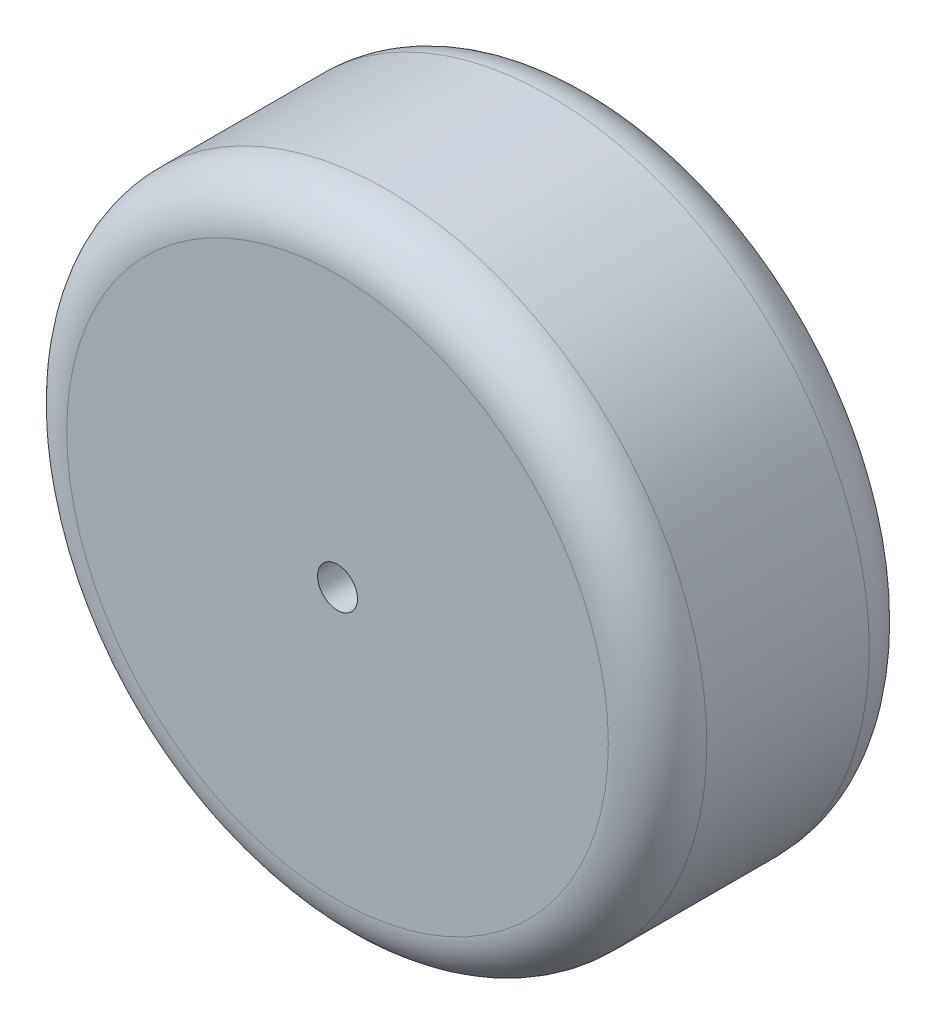
ISO-10303-21;
HEADER;
FILE_DESCRIPTION(('STEP AP214'),'2;1');
FILE_NAME('part.step','',(''),(''),'','','');
FILE_SCHEMA(('AUTOMOTIVE_DESIGN { 1 0 10303 214 1 1 1 1 }'));
ENDSEC;
DATA;
#1=APPLICATION_CONTEXT('core data for automotive mechanical design processes');
#2=APPLICATION_PROTOCOL_DEFINITION('international standard','automotive_design',2000,#1);
#3=PRODUCT_CONTEXT('',#1,'mechanical');
#4=PRODUCT('Part','Part','',(#3));
#5=PRODUCT_RELATED_PRODUCT_CATEGORY('part','',(#4));
#6=PRODUCT_DEFINITION_FORMATION('','',#4);
#7=PRODUCT_DEFINITION_CONTEXT('part definition',#1,'design');
#8=PRODUCT_DEFINITION('design','',#6,#7);
#9=PRODUCT_DEFINITION_SHAPE('','',#8);
#10=(LENGTH_UNIT() NAMED_UNIT(*) SI_UNIT(.MILLI.,.METRE.));
#11=(NAMED_UNIT(*) PLANE_ANGLE_UNIT() SI_UNIT($,.RADIAN.));
#12=(NAMED_UNIT(*) SI_UNIT($,.STERADIAN.) SOLID_ANGLE_UNIT());
#13=UNCERTAINTY_MEASURE_WITH_UNIT(LENGTH_MEASURE(1.E-05),#10,'distance_accuracy_value','');
#14=(GEOMETRIC_REPRESENTATION_CONTEXT(3) GLOBAL_UNCERTAINTY_ASSIGNED_CONTEXT((#13)) GLOBAL_UNIT_ASSIGNED_CONTEXT((#10,
#11,#12)) REPRESENTATION_CONTEXT('',''));
#15=CARTESIAN_POINT('',(0.,0.,0.));
#16=DIRECTION('',(0.,0.,1.));
#17=DIRECTION('',(1.,0.,0.));
#18=AXIS2_PLACEMENT_3D('',#15,#16,#17);
#19=CARTESIAN_POINT('',(0.,0.,23.5));
#20=DIRECTION('',(0.,0.,1.));
#21=DIRECTION('',(1.,0.,0.));
#22=AXIS2_PLACEMENT_3D('',#19,#20,#21);
#23=PLANE('',#22);
#24=CARTESIAN_POINT('',(0.,0.,23.5));
#25=DIRECTION('',(0.,0.,1.));
#26=DIRECTION('',(1.,0.,0.));
#27=AXIS2_PLACEMENT_3D('',#24,#25,#26);
#28=CIRCLE('',#27,13.);
#29=CARTESIAN_POINT('',(13.,0.,23.5));
#30=VERTEX_POINT('',#29);
#31=EDGE_CURVE('E190',#30,#30,#28,.T.);
#32=ORIENTED_EDGE('',*,*,#31,.T.);
#33=EDGE_LOOP('',(#32));
#34=FACE_BOUND('',#33,.T.);
#35=CARTESIAN_POINT('',(0.,0.,23.5));
#36=DIRECTION('',(0.,0.,1.));
#37=DIRECTION('',(1.,0.,0.));
#38=AXIS2_PLACEMENT_3D('',#35,#36,#37);
#39=CIRCLE('',#38,22.5);
#40=CARTESIAN_POINT('',(22.5,0.,23.5));
#41=VERTEX_POINT('',#40);
#42=EDGE_CURVE('E182',#41,#41,#39,.F.);
#43=ORIENTED_EDGE('',*,*,#42,.T.);
#44=EDGE_LOOP('',(#43));
#45=FACE_BOUND('',#44,.T.);
#46=ADVANCED_FACE('F49',(#34,#45),#23,.F.);
#47=CARTESIAN_POINT('',(0.,0.,26.5));
#48=DIRECTION('',(0.,0.,-1.));
#49=DIRECTION('',(-1.,0.,0.));
#50=AXIS2_PLACEMENT_3D('',#47,#48,#49);
#51=CYLINDRICAL_SURFACE('',#50,32.5);
#52=CARTESIAN_POINT('',(0.,0.,21.5));
#53=DIRECTION('',(0.,0.,1.));
#54=DIRECTION('',(1.,0.,0.));
#55=AXIS2_PLACEMENT_3D('',#52,#53,#54);
#56=CIRCLE('',#55,32.5);
#57=CARTESIAN_POINT('',(32.5,0.,21.5));
#58=VERTEX_POINT('',#57);
#59=EDGE_CURVE('E58',#58,#58,#56,.F.);
#60=ORIENTED_EDGE('',*,*,#59,.T.);
#61=EDGE_LOOP('',(#60));
#62=FACE_BOUND('',#61,.T.);
#63=CARTESIAN_POINT('',(0.,0.,5.));
#64=DIRECTION('',(0.,0.,1.));
#65=DIRECTION('',(1.,0.,0.));
#66=AXIS2_PLACEMENT_3D('',#63,#64,#65);
#67=CIRCLE('',#66,32.5);
#68=CARTESIAN_POINT('',(32.5,0.,5.));
#69=VERTEX_POINT('',#68);
#70=EDGE_CURVE('E202',#69,#69,#67,.T.);
#71=ORIENTED_EDGE('',*,*,#70,.T.);
#72=EDGE_LOOP('',(#71));
#73=FACE_BOUND('',#72,.T.);
#74=ADVANCED_FACE('F209',(#62,#73),#51,.T.);
#75=CARTESIAN_POINT('',(0.,0.,26.5));
#76=DIRECTION('',(0.,0.,1.));
#77=DIRECTION('',(1.,0.,0.));
#78=AXIS2_PLACEMENT_3D('',#75,#76,#77);
#79=PLANE('',#78);
#80=CARTESIAN_POINT('',(0.,0.,26.5));
#81=DIRECTION('',(0.,0.,1.));
#82=DIRECTION('',(1.,0.,0.));
#83=AXIS2_PLACEMENT_3D('',#80,#81,#82);
#84=CIRCLE('',#83,27.5);
#85=CARTESIAN_POINT('',(27.5,0.,26.5));
#86=VERTEX_POINT('',#85);
#87=EDGE_CURVE('E194',#86,#86,#84,.T.);
#88=ORIENTED_EDGE('',*,*,#87,.T.);
#89=EDGE_LOOP('',(#88));
#90=FACE_BOUND('',#89,.T.);
#91=CARTESIAN_POINT('',(0.,0.,26.5));
#92=DIRECTION('',(0.,0.,1.));
#93=DIRECTION('',(1.,0.,0.));
#94=AXIS2_PLACEMENT_3D('',#91,#92,#93);
#95=CIRCLE('',#94,2.025);
#96=CARTESIAN_POINT('',(2.025,0.,26.5));
#97=VERTEX_POINT('',#96);
#98=EDGE_CURVE('E198',#97,#97,#95,.T.);
#99=ORIENTED_EDGE('',*,*,#98,.F.);
#100=EDGE_LOOP('',(#99));
#101=FACE_BOUND('',#100,.T.);
#102=ADVANCED_FACE('F218',(#90,#101),#79,.T.);
#103=CARTESIAN_POINT('',(0.,0.,0.));
#104=DIRECTION('',(0.,0.,1.));
#105=DIRECTION('',(1.,0.,0.));
#106=AXIS2_PLACEMENT_3D('',#103,#104,#105);
#107=PLANE('',#106);
#108=CARTESIAN_POINT('',(0.,0.,0.));
#109=DIRECTION('',(0.,0.,1.));
#110=DIRECTION('',(1.,0.,0.));
#111=AXIS2_PLACEMENT_3D('',#108,#109,#110);
#112=CIRCLE('',#111,27.5);
#113=CARTESIAN_POINT('',(27.5,0.,0.));
#114=VERTEX_POINT('',#113);
#115=EDGE_CURVE('E12',#114,#114,#112,.F.);
#116=ORIENTED_EDGE('',*,*,#115,.T.);
#117=EDGE_LOOP('',(#116));
#118=FACE_BOUND('',#117,.T.);
#119=CARTESIAN_POINT('',(0.,0.,0.));
#120=DIRECTION('',(0.,0.,-1.));
#121=DIRECTION('',(-1.,0.,0.));
#122=AXIS2_PLACEMENT_3D('',#119,#120,#121);
#123=CIRCLE('',#122,22.5);
#124=CARTESIAN_POINT('',(-22.5,0.,0.));
#125=VERTEX_POINT('',#124);
#126=EDGE_CURVE('E178',#125,#125,#123,.T.);
#127=ORIENTED_EDGE('',*,*,#126,.F.);
#128=EDGE_LOOP('',(#127));
#129=FACE_BOUND('',#128,.T.);
#130=ADVANCED_FACE('F221',(#118,#129),#107,.F.);
#131=CARTESIAN_POINT('',(0.,0.,90.1396103067893));
#132=DIRECTION('',(0.,0.,-1.));
#133=DIRECTION('',(-1.,0.,0.));
#134=AXIS2_PLACEMENT_3D('',#131,#132,#133);
#135=CYLINDRICAL_SURFACE('',#134,22.5);
#136=ORIENTED_EDGE('',*,*,#126,.T.);
#137=EDGE_LOOP('',(#136));
#138=FACE_BOUND('',#137,.T.);
#139=ORIENTED_EDGE('',*,*,#42,.F.);
#140=EDGE_LOOP('',(#139));
#141=FACE_BOUND('',#140,.T.);
#142=ADVANCED_FACE('F258',(#138,#141),#135,.F.);
#143=CARTESIAN_POINT('',(0.,0.,8.5));
#144=DIRECTION('',(0.,0.,-1.));
#145=DIRECTION('',(-1.,0.,0.));
#146=AXIS2_PLACEMENT_3D('',#143,#144,#145);
#147=PLANE('',#146);
#148=CARTESIAN_POINT('',(0.,0.,8.5));
#149=DIRECTION('',(0.,0.,-1.));
#150=DIRECTION('',(-1.,0.,0.));
#151=AXIS2_PLACEMENT_3D('',#148,#149,#150);
#152=CIRCLE('',#151,9.);
#153=CARTESIAN_POINT('',(-9.,0.,8.5));
#154=VERTEX_POINT('',#153);
#155=EDGE_CURVE('E120',#154,#154,#152,.T.);
#156=ORIENTED_EDGE('',*,*,#155,.T.);
#157=EDGE_LOOP('',(#156));
#158=FACE_BOUND('',#157,.T.);
#159=DIRECTION('',(0.,1.,0.));
#160=VECTOR('',#159,1.);
#161=CARTESIAN_POINT('',(-6.,-3.46410161513776,8.5));
#162=LINE('',#161,#160);
#163=CARTESIAN_POINT('',(-6.,-3.46410161513776,8.5));
#164=VERTEX_POINT('',#163);
#165=CARTESIAN_POINT('',(-6.,3.46410161513776,8.5));
#166=VERTEX_POINT('',#165);
#167=EDGE_CURVE('E111',#164,#166,#162,.T.);
#168=ORIENTED_EDGE('',*,*,#167,.F.);
#169=DIRECTION('',(-0.866025403784439,0.5,0.));
#170=VECTOR('',#169,1.);
#171=CARTESIAN_POINT('',(0.,-6.92820323027551,8.5));
#172=LINE('',#171,#170);
#173=CARTESIAN_POINT('',(0.,-6.92820323027551,8.5));
#174=VERTEX_POINT('',#173);
#175=EDGE_CURVE('E102',#174,#164,#172,.T.);
#176=ORIENTED_EDGE('',*,*,#175,.F.);
#177=DIRECTION('',(-0.866025403784438,-0.5,0.));
#178=VECTOR('',#177,1.);
#179=CARTESIAN_POINT('',(6.,-3.46410161513775,8.5));
#180=LINE('',#179,#178);
#181=CARTESIAN_POINT('',(6.,-3.46410161513775,8.5));
#182=VERTEX_POINT('',#181);
#183=EDGE_CURVE('E139',#182,#174,#180,.T.);
#184=ORIENTED_EDGE('',*,*,#183,.F.);
#185=DIRECTION('',(0.,-1.,0.));
#186=VECTOR('',#185,1.);
#187=CARTESIAN_POINT('',(6.,3.46410161513776,8.5));
#188=LINE('',#187,#186);
#189=CARTESIAN_POINT('',(6.,3.46410161513776,8.5));
#190=VERTEX_POINT('',#189);
#191=EDGE_CURVE('E136',#190,#182,#188,.T.);
#192=ORIENTED_EDGE('',*,*,#191,.F.);
#193=DIRECTION('',(0.866025403784439,-0.5,0.));
#194=VECTOR('',#193,1.);
#195=CARTESIAN_POINT('',(0.,6.92820323027551,8.5));
#196=LINE('',#195,#194);
#197=CARTESIAN_POINT('',(0.,6.92820323027551,8.5));
#198=VERTEX_POINT('',#197);
#199=EDGE_CURVE('E130',#198,#190,#196,.T.);
#200=ORIENTED_EDGE('',*,*,#199,.F.);
#201=DIRECTION('',(0.866025403784439,0.5,0.));
#202=VECTOR('',#201,1.);
#203=CARTESIAN_POINT('',(-6.,3.46410161513776,8.5));
#204=LINE('',#203,#202);
#205=EDGE_CURVE('E126',#166,#198,#204,.T.);
#206=ORIENTED_EDGE('',*,*,#205,.F.);
#207=EDGE_LOOP('',(#168,#176,#184,#192,#200,#206));
#208=FACE_BOUND('',#207,.T.);
#209=ADVANCED_FACE('F124',(#158,#208),#147,.T.);
#210=CARTESIAN_POINT('',(0.,0.,8.5));
#211=DIRECTION('',(0.,0.,1.));
#212=DIRECTION('',(1.,0.,0.));
#213=AXIS2_PLACEMENT_3D('',#210,#211,#212);
#214=CYLINDRICAL_SURFACE('',#213,9.);
#215=CARTESIAN_POINT('',(0.,0.,19.5));
#216=DIRECTION('',(0.,0.,1.));
#217=DIRECTION('',(1.,0.,0.));
#218=AXIS2_PLACEMENT_3D('',#215,#216,#217);
#219=CIRCLE('',#218,9.);
#220=CARTESIAN_POINT('',(9.,0.,19.5));
#221=VERTEX_POINT('',#220);
#222=EDGE_CURVE('E186',#221,#221,#219,.F.);
#223=ORIENTED_EDGE('',*,*,#222,.T.);
#224=EDGE_LOOP('',(#223));
#225=FACE_BOUND('',#224,.T.);
#226=ORIENTED_EDGE('',*,*,#155,.F.);
#227=EDGE_LOOP('',(#226));
#228=FACE_BOUND('',#227,.T.);
#229=ADVANCED_FACE('F272',(#225,#228),#214,.T.);
#230=CARTESIAN_POINT('',(0.,-6.92820323027551,8.5));
#231=DIRECTION('',(0.5,0.866025403784439,0.));
#232=DIRECTION('',(-0.866025403784439,0.5,0.));
#233=AXIS2_PLACEMENT_3D('',#230,#231,#232);
#234=PLANE('',#233);
#235=DIRECTION('',(-0.866025403784439,0.5,0.));
#236=VECTOR('',#235,1.);
#237=CARTESIAN_POINT('',(0.,-6.92820323027551,23.5));
#238=LINE('',#237,#236);
#239=CARTESIAN_POINT('',(0.,-6.92820323027551,23.5));
#240=VERTEX_POINT('',#239);
#241=CARTESIAN_POINT('',(-6.,-3.46410161513776,23.5));
#242=VERTEX_POINT('',#241);
#243=EDGE_CURVE('E142',#240,#242,#238,.T.);
#244=ORIENTED_EDGE('',*,*,#243,.F.);
#245=DIRECTION('',(0.,0.,1.));
#246=VECTOR('',#245,1.);
#247=CARTESIAN_POINT('',(0.,-6.92820323027551,8.5));
#248=LINE('',#247,#246);
#249=EDGE_CURVE('E65',#174,#240,#248,.T.);
#250=ORIENTED_EDGE('',*,*,#249,.F.);
#251=ORIENTED_EDGE('',*,*,#175,.T.);
#252=DIRECTION('',(0.,0.,1.));
#253=VECTOR('',#252,1.);
#254=CARTESIAN_POINT('',(-6.,-3.46410161513776,8.5));
#255=LINE('',#254,#253);
#256=EDGE_CURVE('E105',#164,#242,#255,.T.);
#257=ORIENTED_EDGE('',*,*,#256,.T.);
#258=EDGE_LOOP('',(#244,#250,#251,#257));
#259=FACE_BOUND('',#258,.T.);
#260=ADVANCED_FACE('F104',(#259),#234,.T.);
#261=CARTESIAN_POINT('',(-6.,-3.46410161513776,8.5));
#262=DIRECTION('',(1.,0.,0.));
#263=DIRECTION('',(0.,0.,-1.));
#264=AXIS2_PLACEMENT_3D('',#261,#262,#263);
#265=PLANE('',#264);
#266=DIRECTION('',(0.,1.,0.));
#267=VECTOR('',#266,1.);
#268=CARTESIAN_POINT('',(-6.,-3.46410161513776,23.5));
#269=LINE('',#268,#267);
#270=CARTESIAN_POINT('',(-6.,3.46410161513776,23.5));
#271=VERTEX_POINT('',#270);
#272=EDGE_CURVE('E118',#242,#271,#269,.T.);
#273=ORIENTED_EDGE('',*,*,#272,.F.);
#274=ORIENTED_EDGE('',*,*,#256,.F.);
#275=ORIENTED_EDGE('',*,*,#167,.T.);
#276=DIRECTION('',(0.,0.,1.));
#277=VECTOR('',#276,1.);
#278=CARTESIAN_POINT('',(-6.,3.46410161513776,8.5));
#279=LINE('',#278,#277);
#280=EDGE_CURVE('E121',#166,#271,#279,.T.);
#281=ORIENTED_EDGE('',*,*,#280,.T.);
#282=EDGE_LOOP('',(#273,#274,#275,#281));
#283=FACE_BOUND('',#282,.T.);
#284=ADVANCED_FACE('F115',(#283),#265,.T.);
#285=CARTESIAN_POINT('',(-6.,3.46410161513776,8.5));
#286=DIRECTION('',(0.5,-0.866025403784439,0.));
#287=DIRECTION('',(0.866025403784439,0.5,0.));
#288=AXIS2_PLACEMENT_3D('',#285,#286,#287);
#289=PLANE('',#288);
#290=DIRECTION('',(0.866025403784439,0.5,0.));
#291=VECTOR('',#290,1.);
#292=CARTESIAN_POINT('',(-6.,3.46410161513776,23.5));
#293=LINE('',#292,#291);
#294=CARTESIAN_POINT('',(0.,6.92820323027551,23.5));
#295=VERTEX_POINT('',#294);
#296=EDGE_CURVE('E148',#271,#295,#293,.T.);
#297=ORIENTED_EDGE('',*,*,#296,.F.);
#298=ORIENTED_EDGE('',*,*,#280,.F.);
#299=ORIENTED_EDGE('',*,*,#205,.T.);
#300=DIRECTION('',(0.,0.,1.));
#301=VECTOR('',#300,1.);
#302=CARTESIAN_POINT('',(0.,6.92820323027551,8.5));
#303=LINE('',#302,#301);
#304=EDGE_CURVE('E170',#198,#295,#303,.T.);
#305=ORIENTED_EDGE('',*,*,#304,.T.);
#306=EDGE_LOOP('',(#297,#298,#299,#305));
#307=FACE_BOUND('',#306,.T.);
#308=ADVANCED_FACE('F288',(#307),#289,.T.);
#309=CARTESIAN_POINT('',(0.,6.92820323027551,8.5));
#310=DIRECTION('',(-0.5,-0.866025403784439,0.));
#311=DIRECTION('',(0.866025403784439,-0.5,0.));
#312=AXIS2_PLACEMENT_3D('',#309,#310,#311);
#313=PLANE('',#312);
#314=DIRECTION('',(0.866025403784439,-0.5,0.));
#315=VECTOR('',#314,1.);
#316=CARTESIAN_POINT('',(0.,6.92820323027551,23.5));
#317=LINE('',#316,#315);
#318=CARTESIAN_POINT('',(6.,3.46410161513776,23.5));
#319=VERTEX_POINT('',#318);
#320=EDGE_CURVE('E152',#295,#319,#317,.T.);
#321=ORIENTED_EDGE('',*,*,#320,.F.);
#322=ORIENTED_EDGE('',*,*,#304,.F.);
#323=ORIENTED_EDGE('',*,*,#199,.T.);
#324=DIRECTION('',(0.,0.,1.));
#325=VECTOR('',#324,1.);
#326=CARTESIAN_POINT('',(6.,3.46410161513776,8.5));
#327=LINE('',#326,#325);
#328=EDGE_CURVE('E167',#190,#319,#327,.T.);
#329=ORIENTED_EDGE('',*,*,#328,.T.);
#330=EDGE_LOOP('',(#321,#322,#323,#329));
#331=FACE_BOUND('',#330,.T.);
#332=ADVANCED_FACE('F246',(#331),#313,.T.);
#333=CARTESIAN_POINT('',(6.,3.46410161513776,8.5));
#334=DIRECTION('',(-1.,0.,0.));
#335=DIRECTION('',(0.,0.,1.));
#336=AXIS2_PLACEMENT_3D('',#333,#334,#335);
#337=PLANE('',#336);
#338=DIRECTION('',(0.,-1.,0.));
#339=VECTOR('',#338,1.);
#340=CARTESIAN_POINT('',(6.,3.46410161513776,23.5));
#341=LINE('',#340,#339);
#342=CARTESIAN_POINT('',(6.,-3.46410161513775,23.5));
#343=VERTEX_POINT('',#342);
#344=EDGE_CURVE('E156',#319,#343,#341,.T.);
#345=ORIENTED_EDGE('',*,*,#344,.F.);
#346=ORIENTED_EDGE('',*,*,#328,.F.);
#347=ORIENTED_EDGE('',*,*,#191,.T.);
#348=DIRECTION('',(0.,0.,1.));
#349=VECTOR('',#348,1.);
#350=CARTESIAN_POINT('',(6.,-3.46410161513775,8.5));
#351=LINE('',#350,#349);
#352=EDGE_CURVE('E70',#182,#343,#351,.T.);
#353=ORIENTED_EDGE('',*,*,#352,.T.);
#354=EDGE_LOOP('',(#345,#346,#347,#353));
#355=FACE_BOUND('',#354,.T.);
#356=ADVANCED_FACE('F240',(#355),#337,.T.);
#357=CARTESIAN_POINT('',(6.,-3.46410161513775,8.5));
#358=DIRECTION('',(-0.5,0.866025403784438,0.));
#359=DIRECTION('',(-0.866025403784439,-0.5,0.));
#360=AXIS2_PLACEMENT_3D('',#357,#358,#359);
#361=PLANE('',#360);
#362=DIRECTION('',(-0.866025403784438,-0.5,0.));
#363=VECTOR('',#362,1.);
#364=CARTESIAN_POINT('',(6.,-3.46410161513775,23.5));
#365=LINE('',#364,#363);
#366=EDGE_CURVE('E112',#343,#240,#365,.T.);
#367=ORIENTED_EDGE('',*,*,#366,.F.);
#368=ORIENTED_EDGE('',*,*,#352,.F.);
#369=ORIENTED_EDGE('',*,*,#183,.T.);
#370=ORIENTED_EDGE('',*,*,#249,.T.);
#371=EDGE_LOOP('',(#367,#368,#369,#370));
#372=FACE_BOUND('',#371,.T.);
#373=ADVANCED_FACE('F236',(#372),#361,.T.);
#374=CARTESIAN_POINT('',(0.,0.,23.5));
#375=DIRECTION('',(0.,0.,1.));
#376=DIRECTION('',(1.,0.,0.));
#377=AXIS2_PLACEMENT_3D('',#374,#375,#376);
#378=CIRCLE('',#377,2.025);
#379=CARTESIAN_POINT('',(2.025,0.,23.5));
#380=VERTEX_POINT('',#379);
#381=EDGE_CURVE('E145',#380,#380,#378,.T.);
#382=ORIENTED_EDGE('',*,*,#381,.T.);
#383=EDGE_LOOP('',(#382));
#384=FACE_BOUND('',#383,.T.);
#385=ORIENTED_EDGE('',*,*,#366,.T.);
#386=ORIENTED_EDGE('',*,*,#243,.T.);
#387=ORIENTED_EDGE('',*,*,#272,.T.);
#388=ORIENTED_EDGE('',*,*,#296,.T.);
#389=ORIENTED_EDGE('',*,*,#320,.T.);
#390=ORIENTED_EDGE('',*,*,#344,.T.);
#391=EDGE_LOOP('',(#385,#386,#387,#388,#389,#390));
#392=FACE_BOUND('',#391,.T.);
#393=ADVANCED_FACE('F233',(#384,#392),#23,.F.);
#394=CARTESIAN_POINT('',(0.,0.,19.5));
#395=DIRECTION('',(0.,0.,1.));
#396=DIRECTION('',(1.,0.,0.));
#397=AXIS2_PLACEMENT_3D('',#394,#395,#396);
#398=TOROIDAL_SURFACE('',#397,13.,4.);
#399=ORIENTED_EDGE('',*,*,#31,.F.);
#400=EDGE_LOOP('',(#399));
#401=FACE_BOUND('',#400,.T.);
#402=ORIENTED_EDGE('',*,*,#222,.F.);
#403=EDGE_LOOP('',(#402));
#404=FACE_BOUND('',#403,.T.);
#405=ADVANCED_FACE('F229',(#401,#404),#398,.F.);
#406=CARTESIAN_POINT('',(0.,0.,0.));
#407=DIRECTION('',(0.,0.,1.));
#408=DIRECTION('',(1.,0.,0.));
#409=AXIS2_PLACEMENT_3D('',#406,#407,#408);
#410=CYLINDRICAL_SURFACE('',#409,2.025);
#411=ORIENTED_EDGE('',*,*,#98,.T.);
#412=EDGE_LOOP('',(#411));
#413=FACE_BOUND('',#412,.T.);
#414=ORIENTED_EDGE('',*,*,#381,.F.);
#415=EDGE_LOOP('',(#414));
#416=FACE_BOUND('',#415,.T.);
#417=ADVANCED_FACE('F215',(#413,#416),#410,.F.);
#418=CARTESIAN_POINT('',(0.,0.,21.5));
#419=DIRECTION('',(0.,0.,1.));
#420=DIRECTION('',(1.,0.,0.));
#421=AXIS2_PLACEMENT_3D('',#418,#419,#420);
#422=TOROIDAL_SURFACE('',#421,27.5,5.);
#423=ORIENTED_EDGE('',*,*,#59,.F.);
#424=EDGE_LOOP('',(#423));
#425=FACE_BOUND('',#424,.T.);
#426=ORIENTED_EDGE('',*,*,#87,.F.);
#427=EDGE_LOOP('',(#426));
#428=FACE_BOUND('',#427,.T.);
#429=ADVANCED_FACE('F212',(#425,#428),#422,.T.);
#430=CARTESIAN_POINT('',(0.,0.,5.));
#431=DIRECTION('',(0.,0.,1.));
#432=DIRECTION('',(1.,0.,0.));
#433=AXIS2_PLACEMENT_3D('',#430,#431,#432);
#434=TOROIDAL_SURFACE('',#433,27.5,5.);
#435=ORIENTED_EDGE('',*,*,#115,.F.);
#436=EDGE_LOOP('',(#435));
#437=FACE_BOUND('',#436,.T.);
#438=ORIENTED_EDGE('',*,*,#70,.F.);
#439=EDGE_LOOP('',(#438));
#440=FACE_BOUND('',#439,.T.);
#441=ADVANCED_FACE('F51',(#437,#440),#434,.T.);
#442=CLOSED_SHELL('',(#46,#74,#102,#130,#142,#209,#229,#260,#284,#308,#332,#356,#373,#393,#405,
#417,#429,#441));
#443=MANIFOLD_SOLID_BREP('B2',#442);
#444=ADVANCED_BREP_SHAPE_REPRESENTATION('',(#18,#443),#14);
#445=SHAPE_DEFINITION_REPRESENTATION(#9,#444);
ENDSEC;
END-ISO-10303-21;
